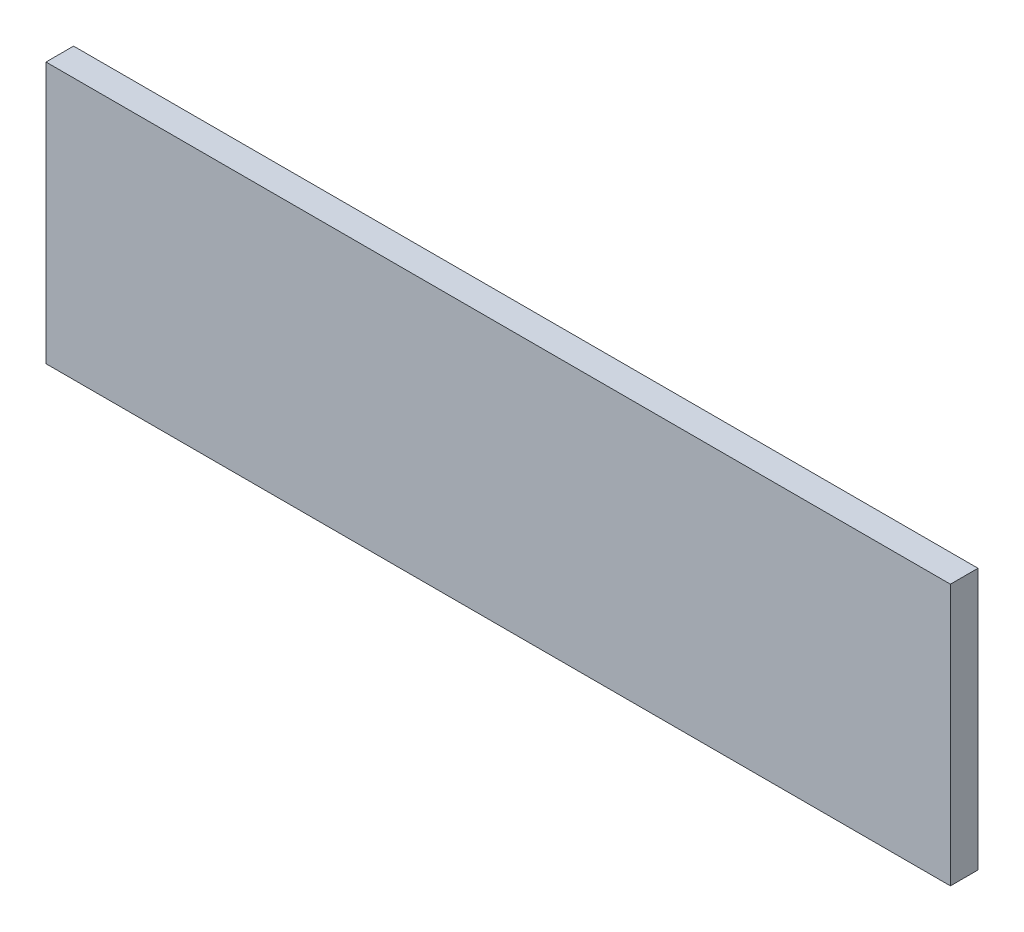
ISO-10303-21;
HEADER;
FILE_DESCRIPTION(('STEP AP214'),'2;1');
FILE_NAME('part.step','',(''),(''),'','','');
FILE_SCHEMA(('AUTOMOTIVE_DESIGN { 1 0 10303 214 1 1 1 1 }'));
ENDSEC;
DATA;
#1=APPLICATION_CONTEXT('core data for automotive mechanical design processes');
#2=APPLICATION_PROTOCOL_DEFINITION('international standard','automotive_design',2000,#1);
#3=PRODUCT_CONTEXT('',#1,'mechanical');
#4=PRODUCT('Part','Part','',(#3));
#5=PRODUCT_RELATED_PRODUCT_CATEGORY('part','',(#4));
#6=PRODUCT_DEFINITION_FORMATION('','',#4);
#7=PRODUCT_DEFINITION_CONTEXT('part definition',#1,'design');
#8=PRODUCT_DEFINITION('design','',#6,#7);
#9=PRODUCT_DEFINITION_SHAPE('','',#8);
#10=(LENGTH_UNIT() NAMED_UNIT(*) SI_UNIT(.MILLI.,.METRE.));
#11=(NAMED_UNIT(*) PLANE_ANGLE_UNIT() SI_UNIT($,.RADIAN.));
#12=(NAMED_UNIT(*) SI_UNIT($,.STERADIAN.) SOLID_ANGLE_UNIT());
#13=UNCERTAINTY_MEASURE_WITH_UNIT(LENGTH_MEASURE(1.E-05),#10,'distance_accuracy_value','');
#14=(GEOMETRIC_REPRESENTATION_CONTEXT(3) GLOBAL_UNCERTAINTY_ASSIGNED_CONTEXT((#13)) GLOBAL_UNIT_ASSIGNED_CONTEXT((#10,
#11,#12)) REPRESENTATION_CONTEXT('',''));
#15=CARTESIAN_POINT('',(0.,0.,0.));
#16=DIRECTION('',(0.,0.,1.));
#17=DIRECTION('',(1.,0.,0.));
#18=AXIS2_PLACEMENT_3D('',#15,#16,#17);
#19=CARTESIAN_POINT('',(-311.5,-90.,19.));
#20=DIRECTION('',(1.,0.,0.));
#21=DIRECTION('',(0.,0.,-1.));
#22=AXIS2_PLACEMENT_3D('',#19,#20,#21);
#23=PLANE('',#22);
#24=DIRECTION('',(0.,-1.,0.));
#25=VECTOR('',#24,1.);
#26=CARTESIAN_POINT('',(-311.5,-90.,0.));
#27=LINE('',#26,#25);
#28=CARTESIAN_POINT('',(-311.5,90.,0.));
#29=VERTEX_POINT('',#28);
#30=CARTESIAN_POINT('',(-311.5,-90.,0.));
#31=VERTEX_POINT('',#30);
#32=EDGE_CURVE('E96',#29,#31,#27,.T.);
#33=ORIENTED_EDGE('',*,*,#32,.T.);
#34=DIRECTION('',(0.,0.,-1.));
#35=VECTOR('',#34,1.);
#36=CARTESIAN_POINT('',(-311.5,-90.,19.));
#37=LINE('',#36,#35);
#38=CARTESIAN_POINT('',(-311.5,-90.,19.));
#39=VERTEX_POINT('',#38);
#40=EDGE_CURVE('E11',#39,#31,#37,.T.);
#41=ORIENTED_EDGE('',*,*,#40,.F.);
#42=DIRECTION('',(0.,-1.,0.));
#43=VECTOR('',#42,1.);
#44=CARTESIAN_POINT('',(-311.5,-90.,19.));
#45=LINE('',#44,#43);
#46=CARTESIAN_POINT('',(-311.5,90.,19.));
#47=VERTEX_POINT('',#46);
#48=EDGE_CURVE('E84',#47,#39,#45,.T.);
#49=ORIENTED_EDGE('',*,*,#48,.F.);
#50=DIRECTION('',(0.,0.,-1.));
#51=VECTOR('',#50,1.);
#52=CARTESIAN_POINT('',(-311.5,90.,19.));
#53=LINE('',#52,#51);
#54=EDGE_CURVE('E92',#47,#29,#53,.T.);
#55=ORIENTED_EDGE('',*,*,#54,.T.);
#56=EDGE_LOOP('',(#33,#41,#49,#55));
#57=FACE_BOUND('',#56,.T.);
#58=ADVANCED_FACE('F33',(#57),#23,.F.);
#59=CARTESIAN_POINT('',(311.5,-89.9999999999999,19.));
#60=DIRECTION('',(0.,1.,0.));
#61=DIRECTION('',(-1.,0.,0.));
#62=AXIS2_PLACEMENT_3D('',#59,#60,#61);
#63=PLANE('',#62);
#64=DIRECTION('',(1.,0.,0.));
#65=VECTOR('',#64,1.);
#66=CARTESIAN_POINT('',(311.5,-89.9999999999999,0.));
#67=LINE('',#66,#65);
#68=CARTESIAN_POINT('',(311.5,-89.9999999999999,0.));
#69=VERTEX_POINT('',#68);
#70=EDGE_CURVE('E88',#31,#69,#67,.T.);
#71=ORIENTED_EDGE('',*,*,#70,.T.);
#72=DIRECTION('',(0.,0.,-1.));
#73=VECTOR('',#72,1.);
#74=CARTESIAN_POINT('',(311.5,-89.9999999999999,19.));
#75=LINE('',#74,#73);
#76=CARTESIAN_POINT('',(311.5,-89.9999999999999,19.));
#77=VERTEX_POINT('',#76);
#78=EDGE_CURVE('E41',#77,#69,#75,.T.);
#79=ORIENTED_EDGE('',*,*,#78,.F.);
#80=DIRECTION('',(1.,0.,0.));
#81=VECTOR('',#80,1.);
#82=CARTESIAN_POINT('',(311.5,-89.9999999999999,19.));
#83=LINE('',#82,#81);
#84=EDGE_CURVE('E79',#39,#77,#83,.T.);
#85=ORIENTED_EDGE('',*,*,#84,.F.);
#86=ORIENTED_EDGE('',*,*,#40,.T.);
#87=EDGE_LOOP('',(#71,#79,#85,#86));
#88=FACE_BOUND('',#87,.T.);
#89=ADVANCED_FACE('F87',(#88),#63,.F.);
#90=CARTESIAN_POINT('',(311.5,-89.9999999999999,19.));
#91=DIRECTION('',(-1.,0.,0.));
#92=DIRECTION('',(0.,0.,1.));
#93=AXIS2_PLACEMENT_3D('',#90,#91,#92);
#94=PLANE('',#93);
#95=DIRECTION('',(0.,1.,0.));
#96=VECTOR('',#95,1.);
#97=CARTESIAN_POINT('',(311.5,-89.9999999999999,0.));
#98=LINE('',#97,#96);
#99=CARTESIAN_POINT('',(311.5,90.0000000000001,0.));
#100=VERTEX_POINT('',#99);
#101=EDGE_CURVE('E66',#69,#100,#98,.T.);
#102=ORIENTED_EDGE('',*,*,#101,.T.);
#103=DIRECTION('',(0.,0.,-1.));
#104=VECTOR('',#103,1.);
#105=CARTESIAN_POINT('',(311.5,90.0000000000001,19.));
#106=LINE('',#105,#104);
#107=CARTESIAN_POINT('',(311.5,90.0000000000001,19.));
#108=VERTEX_POINT('',#107);
#109=EDGE_CURVE('E89',#108,#100,#106,.T.);
#110=ORIENTED_EDGE('',*,*,#109,.F.);
#111=DIRECTION('',(0.,1.,0.));
#112=VECTOR('',#111,1.);
#113=CARTESIAN_POINT('',(311.5,-89.9999999999999,19.));
#114=LINE('',#113,#112);
#115=EDGE_CURVE('E82',#77,#108,#114,.T.);
#116=ORIENTED_EDGE('',*,*,#115,.F.);
#117=ORIENTED_EDGE('',*,*,#78,.T.);
#118=EDGE_LOOP('',(#102,#110,#116,#117));
#119=FACE_BOUND('',#118,.T.);
#120=ADVANCED_FACE('F90',(#119),#94,.F.);
#121=CARTESIAN_POINT('',(311.5,90.0000000000001,19.));
#122=DIRECTION('',(0.,-1.,0.));
#123=DIRECTION('',(1.,0.,0.));
#124=AXIS2_PLACEMENT_3D('',#121,#122,#123);
#125=PLANE('',#124);
#126=DIRECTION('',(-1.,0.,0.));
#127=VECTOR('',#126,1.);
#128=CARTESIAN_POINT('',(311.5,90.0000000000001,0.));
#129=LINE('',#128,#127);
#130=EDGE_CURVE('E72',#100,#29,#129,.T.);
#131=ORIENTED_EDGE('',*,*,#130,.T.);
#132=ORIENTED_EDGE('',*,*,#54,.F.);
#133=DIRECTION('',(-1.,0.,0.));
#134=VECTOR('',#133,1.);
#135=CARTESIAN_POINT('',(311.5,90.0000000000001,19.));
#136=LINE('',#135,#134);
#137=EDGE_CURVE('E49',#108,#47,#136,.T.);
#138=ORIENTED_EDGE('',*,*,#137,.F.);
#139=ORIENTED_EDGE('',*,*,#109,.T.);
#140=EDGE_LOOP('',(#131,#132,#138,#139));
#141=FACE_BOUND('',#140,.T.);
#142=ADVANCED_FACE('F103',(#141),#125,.F.);
#143=CARTESIAN_POINT('',(0.,0.,19.));
#144=DIRECTION('',(0.,0.,1.));
#145=DIRECTION('',(1.,0.,0.));
#146=AXIS2_PLACEMENT_3D('',#143,#144,#145);
#147=PLANE('',#146);
#148=ORIENTED_EDGE('',*,*,#48,.T.);
#149=ORIENTED_EDGE('',*,*,#84,.T.);
#150=ORIENTED_EDGE('',*,*,#115,.T.);
#151=ORIENTED_EDGE('',*,*,#137,.T.);
#152=EDGE_LOOP('',(#148,#149,#150,#151));
#153=FACE_BOUND('',#152,.T.);
#154=ADVANCED_FACE('F80',(#153),#147,.T.);
#155=CARTESIAN_POINT('',(0.,0.,0.));
#156=DIRECTION('',(0.,0.,1.));
#157=DIRECTION('',(1.,0.,0.));
#158=AXIS2_PLACEMENT_3D('',#155,#156,#157);
#159=PLANE('',#158);
#160=ORIENTED_EDGE('',*,*,#32,.F.);
#161=ORIENTED_EDGE('',*,*,#130,.F.);
#162=ORIENTED_EDGE('',*,*,#101,.F.);
#163=ORIENTED_EDGE('',*,*,#70,.F.);
#164=EDGE_LOOP('',(#160,#161,#162,#163));
#165=FACE_BOUND('',#164,.T.);
#166=ADVANCED_FACE('F106',(#165),#159,.F.);
#167=CLOSED_SHELL('',(#58,#89,#120,#142,#154,#166));
#168=MANIFOLD_SOLID_BREP('B2',#167);
#169=ADVANCED_BREP_SHAPE_REPRESENTATION('',(#18,#168),#14);
#170=SHAPE_DEFINITION_REPRESENTATION(#9,#169);
ENDSEC;
END-ISO-10303-21;
